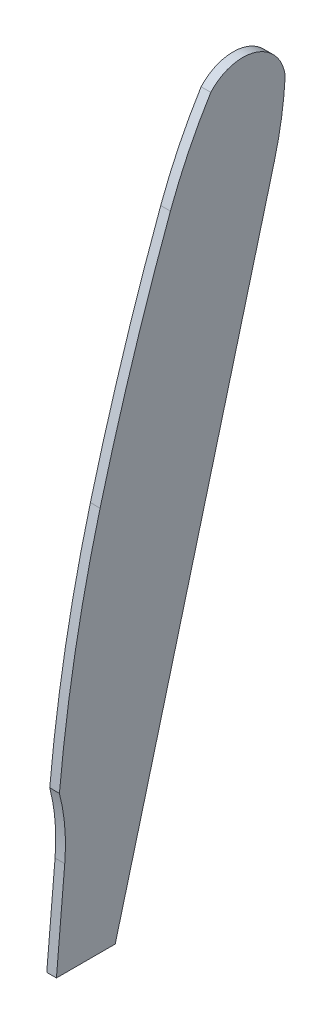
ISO-10303-21;
HEADER;
FILE_DESCRIPTION(('STEP AP214'),'2;1');
FILE_NAME('part.step','',(''),(''),'','','');
FILE_SCHEMA(('AUTOMOTIVE_DESIGN { 1 0 10303 214 1 1 1 1 }'));
ENDSEC;
DATA;
#1=APPLICATION_CONTEXT('core data for automotive mechanical design processes');
#2=APPLICATION_PROTOCOL_DEFINITION('international standard','automotive_design',2000,#1);
#3=PRODUCT_CONTEXT('',#1,'mechanical');
#4=PRODUCT('Part','Part','',(#3));
#5=PRODUCT_RELATED_PRODUCT_CATEGORY('part','',(#4));
#6=PRODUCT_DEFINITION_FORMATION('','',#4);
#7=PRODUCT_DEFINITION_CONTEXT('part definition',#1,'design');
#8=PRODUCT_DEFINITION('design','',#6,#7);
#9=PRODUCT_DEFINITION_SHAPE('','',#8);
#10=(LENGTH_UNIT() NAMED_UNIT(*) SI_UNIT(.MILLI.,.METRE.));
#11=(NAMED_UNIT(*) PLANE_ANGLE_UNIT() SI_UNIT($,.RADIAN.));
#12=(NAMED_UNIT(*) SI_UNIT($,.STERADIAN.) SOLID_ANGLE_UNIT());
#13=UNCERTAINTY_MEASURE_WITH_UNIT(LENGTH_MEASURE(1.E-05),#10,'distance_accuracy_value','');
#14=(GEOMETRIC_REPRESENTATION_CONTEXT(3) GLOBAL_UNCERTAINTY_ASSIGNED_CONTEXT((#13)) GLOBAL_UNIT_ASSIGNED_CONTEXT((#10,
#11,#12)) REPRESENTATION_CONTEXT('',''));
#15=CARTESIAN_POINT('',(0.,0.,0.));
#16=DIRECTION('',(0.,0.,1.));
#17=DIRECTION('',(1.,0.,0.));
#18=AXIS2_PLACEMENT_3D('',#15,#16,#17);
#19=CARTESIAN_POINT('',(1.4,0.,-8.5));
#20=DIRECTION('',(0.,1.,0.));
#21=DIRECTION('',(0.,0.,1.));
#22=AXIS2_PLACEMENT_3D('',#19,#20,#21);
#23=PLANE('',#22);
#24=DIRECTION('',(0.,0.,-1.));
#25=VECTOR('',#24,1.);
#26=CARTESIAN_POINT('',(0.,0.,-8.5));
#27=LINE('',#26,#25);
#28=CARTESIAN_POINT('',(0.,0.,0.));
#29=VERTEX_POINT('',#28);
#30=CARTESIAN_POINT('',(0.,0.,-8.5));
#31=VERTEX_POINT('',#30);
#32=EDGE_CURVE('E137',#29,#31,#27,.T.);
#33=ORIENTED_EDGE('',*,*,#32,.T.);
#34=DIRECTION('',(-1.,0.,0.));
#35=VECTOR('',#34,1.);
#36=CARTESIAN_POINT('',(1.4,0.,-8.5));
#37=LINE('',#36,#35);
#38=CARTESIAN_POINT('',(1.4,0.,-8.5));
#39=VERTEX_POINT('',#38);
#40=EDGE_CURVE('E11',#39,#31,#37,.T.);
#41=ORIENTED_EDGE('',*,*,#40,.F.);
#42=DIRECTION('',(0.,0.,-1.));
#43=VECTOR('',#42,1.);
#44=CARTESIAN_POINT('',(1.4,0.,-8.5));
#45=LINE('',#44,#43);
#46=CARTESIAN_POINT('',(1.4,0.,0.));
#47=VERTEX_POINT('',#46);
#48=EDGE_CURVE('E153',#47,#39,#45,.T.);
#49=ORIENTED_EDGE('',*,*,#48,.F.);
#50=DIRECTION('',(-1.,0.,0.));
#51=VECTOR('',#50,1.);
#52=CARTESIAN_POINT('',(1.4,0.,0.));
#53=LINE('',#52,#51);
#54=EDGE_CURVE('E133',#47,#29,#53,.T.);
#55=ORIENTED_EDGE('',*,*,#54,.T.);
#56=EDGE_LOOP('',(#33,#41,#49,#55));
#57=FACE_BOUND('',#56,.T.);
#58=ADVANCED_FACE('F35',(#57),#23,.F.);
#59=CARTESIAN_POINT('',(1.4,0.,-8.5));
#60=DIRECTION('',(0.,0.257025772581627,0.96640454894874));
#61=DIRECTION('',(0.,-0.96640454894874,0.257025772581627));
#62=AXIS2_PLACEMENT_3D('',#59,#60,#61);
#63=PLANE('',#62);
#64=DIRECTION('',(0.,0.96640454894874,-0.257025772581627));
#65=VECTOR('',#64,1.);
#66=CARTESIAN_POINT('',(0.,0.,-8.5));
#67=LINE('',#66,#65);
#68=CARTESIAN_POINT('',(0.,86.464518252935,-31.4961765277634));
#69=VERTEX_POINT('',#68);
#70=EDGE_CURVE('E140',#31,#69,#67,.T.);
#71=ORIENTED_EDGE('',*,*,#70,.T.);
#72=DIRECTION('',(-1.,0.,0.));
#73=VECTOR('',#72,1.);
#74=CARTESIAN_POINT('',(1.4,86.464518252935,-31.4961765277634));
#75=LINE('',#74,#73);
#76=CARTESIAN_POINT('',(1.4,86.464518252935,-31.4961765277634));
#77=VERTEX_POINT('',#76);
#78=EDGE_CURVE('E43',#77,#69,#75,.T.);
#79=ORIENTED_EDGE('',*,*,#78,.F.);
#80=DIRECTION('',(0.,0.96640454894874,-0.257025772581627));
#81=VECTOR('',#80,1.);
#82=CARTESIAN_POINT('',(1.4,0.,-8.5));
#83=LINE('',#82,#81);
#84=EDGE_CURVE('E97',#39,#77,#83,.T.);
#85=ORIENTED_EDGE('',*,*,#84,.F.);
#86=ORIENTED_EDGE('',*,*,#40,.T.);
#87=EDGE_LOOP('',(#71,#79,#85,#86));
#88=FACE_BOUND('',#87,.T.);
#89=ADVANCED_FACE('F196',(#88),#63,.F.);
#90=CARTESIAN_POINT('',(1.4,99.2010653887143,16.3926284208069));
#91=DIRECTION('',(-1.,0.,0.));
#92=DIRECTION('',(0.,0.,1.));
#93=AXIS2_PLACEMENT_3D('',#90,#91,#92);
#94=CYLINDRICAL_SURFACE('',#93,49.5535798136133);
#95=CARTESIAN_POINT('',(0.,99.2010653887143,16.3926284208069));
#96=DIRECTION('',(1.,0.,0.));
#97=DIRECTION('',(0.,0.,-1.));
#98=AXIS2_PLACEMENT_3D('',#95,#96,#97);
#99=CIRCLE('',#98,49.5535798136133);
#100=CARTESIAN_POINT('',(0.,96.5026239787442,-33.0874249977283));
#101=VERTEX_POINT('',#100);
#102=EDGE_CURVE('E142',#69,#101,#99,.T.);
#103=ORIENTED_EDGE('',*,*,#102,.T.);
#104=DIRECTION('',(-1.,0.,0.));
#105=VECTOR('',#104,1.);
#106=CARTESIAN_POINT('',(1.4,96.5026239787442,-33.0874249977283));
#107=LINE('',#106,#105);
#108=CARTESIAN_POINT('',(1.4,96.5026239787442,-33.0874249977283));
#109=VERTEX_POINT('',#108);
#110=EDGE_CURVE('E163',#109,#101,#107,.T.);
#111=ORIENTED_EDGE('',*,*,#110,.F.);
#112=CARTESIAN_POINT('',(1.4,99.2010653887143,16.3926284208069));
#113=DIRECTION('',(1.,0.,0.));
#114=DIRECTION('',(0.,0.,-1.));
#115=AXIS2_PLACEMENT_3D('',#112,#113,#114);
#116=CIRCLE('',#115,49.5535798136133);
#117=EDGE_CURVE('E171',#77,#109,#116,.T.);
#118=ORIENTED_EDGE('',*,*,#117,.F.);
#119=ORIENTED_EDGE('',*,*,#78,.T.);
#120=EDGE_LOOP('',(#103,#111,#118,#119));
#121=FACE_BOUND('',#120,.T.);
#122=ADVANCED_FACE('F169',(#121),#94,.T.);
#123=CARTESIAN_POINT('',(1.4,95.6035626525631,-26.940646976806));
#124=DIRECTION('',(-1.,0.,0.));
#125=DIRECTION('',(0.,0.,1.));
#126=AXIS2_PLACEMENT_3D('',#123,#124,#125);
#127=CYLINDRICAL_SURFACE('',#126,6.21218088168139);
#128=CARTESIAN_POINT('',(0.,95.6035626525631,-26.940646976806));
#129=DIRECTION('',(1.,0.,0.));
#130=DIRECTION('',(0.,0.,-1.));
#131=AXIS2_PLACEMENT_3D('',#128,#129,#130);
#132=CIRCLE('',#131,6.21218088168139);
#133=CARTESIAN_POINT('',(0.,99.7570947955704,-22.3211922423451));
#134=VERTEX_POINT('',#133);
#135=EDGE_CURVE('E144',#101,#134,#132,.T.);
#136=ORIENTED_EDGE('',*,*,#135,.T.);
#137=DIRECTION('',(-1.,0.,0.));
#138=VECTOR('',#137,1.);
#139=CARTESIAN_POINT('',(1.4,99.7570947955704,-22.3211922423451));
#140=LINE('',#139,#138);
#141=CARTESIAN_POINT('',(1.4,99.7570947955704,-22.3211922423451));
#142=VERTEX_POINT('',#141);
#143=EDGE_CURVE('E160',#142,#134,#140,.T.);
#144=ORIENTED_EDGE('',*,*,#143,.F.);
#145=CARTESIAN_POINT('',(1.4,95.6035626525631,-26.940646976806));
#146=DIRECTION('',(1.,0.,0.));
#147=DIRECTION('',(0.,0.,-1.));
#148=AXIS2_PLACEMENT_3D('',#145,#146,#147);
#149=CIRCLE('',#148,6.21218088168139);
#150=EDGE_CURVE('E187',#109,#142,#149,.T.);
#151=ORIENTED_EDGE('',*,*,#150,.F.);
#152=ORIENTED_EDGE('',*,*,#110,.T.);
#153=EDGE_LOOP('',(#136,#144,#151,#152));
#154=FACE_BOUND('',#153,.T.);
#155=ADVANCED_FACE('F180',(#154),#127,.T.);
#156=CARTESIAN_POINT('',(1.4,64.8381695956375,-78.6382028272435));
#157=DIRECTION('',(-1.,0.,0.));
#158=DIRECTION('',(0.,0.,1.));
#159=AXIS2_PLACEMENT_3D('',#156,#157,#158);
#160=CYLINDRICAL_SURFACE('',#159,66.264145797996);
#161=CARTESIAN_POINT('',(0.,64.8381695956375,-78.6382028272435));
#162=DIRECTION('',(1.,0.,0.));
#163=DIRECTION('',(0.,0.,1.));
#164=AXIS2_PLACEMENT_3D('',#161,#162,#163);
#165=CIRCLE('',#164,66.264145797996);
#166=CARTESIAN_POINT('',(0.,87.7991910712251,-16.4793055466798));
#167=VERTEX_POINT('',#166);
#168=EDGE_CURVE('E146',#134,#167,#165,.T.);
#169=ORIENTED_EDGE('',*,*,#168,.T.);
#170=DIRECTION('',(-1.,0.,0.));
#171=VECTOR('',#170,1.);
#172=CARTESIAN_POINT('',(1.4,87.7991910712251,-16.4793055466798));
#173=LINE('',#172,#171);
#174=CARTESIAN_POINT('',(1.4,87.7991910712251,-16.4793055466798));
#175=VERTEX_POINT('',#174);
#176=EDGE_CURVE('E157',#175,#167,#173,.T.);
#177=ORIENTED_EDGE('',*,*,#176,.F.);
#178=CARTESIAN_POINT('',(1.4,64.8381695956375,-78.6382028272435));
#179=DIRECTION('',(1.,0.,0.));
#180=DIRECTION('',(0.,0.,1.));
#181=AXIS2_PLACEMENT_3D('',#178,#179,#180);
#182=CIRCLE('',#181,66.264145797996);
#183=EDGE_CURVE('E186',#142,#175,#182,.T.);
#184=ORIENTED_EDGE('',*,*,#183,.F.);
#185=ORIENTED_EDGE('',*,*,#143,.T.);
#186=EDGE_LOOP('',(#169,#177,#184,#185));
#187=FACE_BOUND('',#186,.T.);
#188=ADVANCED_FACE('F184',(#187),#160,.T.);
#189=CARTESIAN_POINT('',(1.4,-35.9600301965743,-351.513908884616));
#190=DIRECTION('',(-1.,0.,0.));
#191=DIRECTION('',(0.,0.,1.));
#192=AXIS2_PLACEMENT_3D('',#189,#190,#191);
#193=CYLINDRICAL_SURFACE('',#192,357.161770466298);
#194=CARTESIAN_POINT('',(0.,-35.9600301965743,-351.513908884616));
#195=DIRECTION('',(1.,0.,0.));
#196=DIRECTION('',(0.,0.,1.));
#197=AXIS2_PLACEMENT_3D('',#194,#195,#196);
#198=CIRCLE('',#197,357.161770466298);
#199=CARTESIAN_POINT('',(0.,55.6832842812047,-6.30957346261224));
#200=VERTEX_POINT('',#199);
#201=EDGE_CURVE('E148',#167,#200,#198,.T.);
#202=ORIENTED_EDGE('',*,*,#201,.T.);
#203=DIRECTION('',(-1.,0.,0.));
#204=VECTOR('',#203,1.);
#205=CARTESIAN_POINT('',(1.4,55.6832842812047,-6.30957346261224));
#206=LINE('',#205,#204);
#207=CARTESIAN_POINT('',(1.4,55.6832842812047,-6.30957346261224));
#208=VERTEX_POINT('',#207);
#209=EDGE_CURVE('E128',#208,#200,#206,.T.);
#210=ORIENTED_EDGE('',*,*,#209,.F.);
#211=CARTESIAN_POINT('',(1.4,-35.9600301965743,-351.513908884616));
#212=DIRECTION('',(1.,0.,0.));
#213=DIRECTION('',(0.,0.,1.));
#214=AXIS2_PLACEMENT_3D('',#211,#212,#213);
#215=CIRCLE('',#214,357.161770466298);
#216=EDGE_CURVE('E119',#175,#208,#215,.T.);
#217=ORIENTED_EDGE('',*,*,#216,.F.);
#218=ORIENTED_EDGE('',*,*,#176,.T.);
#219=EDGE_LOOP('',(#202,#210,#217,#218));
#220=FACE_BOUND('',#219,.T.);
#221=ADVANCED_FACE('F208',(#220),#193,.T.);
#222=CARTESIAN_POINT('',(1.4,3.48156872186903,-202.944304869215));
#223=DIRECTION('',(-1.,0.,0.));
#224=DIRECTION('',(0.,0.,1.));
#225=AXIS2_PLACEMENT_3D('',#222,#223,#224);
#226=CYLINDRICAL_SURFACE('',#225,203.445906084848);
#227=CARTESIAN_POINT('',(0.,3.48156872186903,-202.944304869215));
#228=DIRECTION('',(1.,0.,0.));
#229=DIRECTION('',(0.,0.,-1.));
#230=AXIS2_PLACEMENT_3D('',#227,#228,#229);
#231=CIRCLE('',#230,203.445906084848);
#232=CARTESIAN_POINT('',(0.,22.9077607824969,-0.42798512014347));
#233=VERTEX_POINT('',#232);
#234=EDGE_CURVE('E127',#200,#233,#231,.T.);
#235=ORIENTED_EDGE('',*,*,#234,.T.);
#236=DIRECTION('',(-1.,0.,0.));
#237=VECTOR('',#236,1.);
#238=CARTESIAN_POINT('',(1.4,22.9077607824969,-0.42798512014347));
#239=LINE('',#238,#237);
#240=CARTESIAN_POINT('',(1.4,22.9077607824969,-0.42798512014347));
#241=VERTEX_POINT('',#240);
#242=EDGE_CURVE('E124',#241,#233,#239,.T.);
#243=ORIENTED_EDGE('',*,*,#242,.F.);
#244=CARTESIAN_POINT('',(1.4,3.48156872186903,-202.944304869215));
#245=DIRECTION('',(1.,0.,0.));
#246=DIRECTION('',(0.,0.,-1.));
#247=AXIS2_PLACEMENT_3D('',#244,#245,#246);
#248=CIRCLE('',#247,203.445906084848);
#249=EDGE_CURVE('E113',#208,#241,#248,.T.);
#250=ORIENTED_EDGE('',*,*,#249,.F.);
#251=ORIENTED_EDGE('',*,*,#209,.T.);
#252=EDGE_LOOP('',(#235,#243,#250,#251));
#253=FACE_BOUND('',#252,.T.);
#254=ADVANCED_FACE('F125',(#253),#226,.T.);
#255=CARTESIAN_POINT('',(1.4,16.0787244802433,25.7745970400898));
#256=DIRECTION('',(-1.,0.,0.));
#257=DIRECTION('',(0.,0.,1.));
#258=AXIS2_PLACEMENT_3D('',#255,#256,#257);
#259=CYLINDRICAL_SURFACE('',#258,27.0778700912992);
#260=CARTESIAN_POINT('',(0.,16.0787244802433,25.7745970400898));
#261=DIRECTION('',(-1.,0.,0.));
#262=DIRECTION('',(0.,0.,-1.));
#263=AXIS2_PLACEMENT_3D('',#260,#261,#262);
#264=CIRCLE('',#263,27.0778700912992);
#265=CARTESIAN_POINT('',(0.,13.7187326004116,-1.20023358047949));
#266=VERTEX_POINT('',#265);
#267=EDGE_CURVE('E83',#233,#266,#264,.T.);
#268=ORIENTED_EDGE('',*,*,#267,.T.);
#269=DIRECTION('',(-1.,0.,0.));
#270=VECTOR('',#269,1.);
#271=CARTESIAN_POINT('',(1.4,13.7187326004116,-1.20023358047949));
#272=LINE('',#271,#270);
#273=CARTESIAN_POINT('',(1.4,13.7187326004116,-1.20023358047949));
#274=VERTEX_POINT('',#273);
#275=EDGE_CURVE('E129',#274,#266,#272,.T.);
#276=ORIENTED_EDGE('',*,*,#275,.F.);
#277=CARTESIAN_POINT('',(1.4,16.0787244802433,25.7745970400898));
#278=DIRECTION('',(-1.,0.,0.));
#279=DIRECTION('',(0.,0.,-1.));
#280=AXIS2_PLACEMENT_3D('',#277,#278,#279);
#281=CIRCLE('',#280,27.0778700912992);
#282=EDGE_CURVE('E117',#241,#274,#281,.T.);
#283=ORIENTED_EDGE('',*,*,#282,.F.);
#284=ORIENTED_EDGE('',*,*,#242,.T.);
#285=EDGE_LOOP('',(#268,#276,#283,#284));
#286=FACE_BOUND('',#285,.T.);
#287=ADVANCED_FACE('F131',(#286),#259,.F.);
#288=CARTESIAN_POINT('',(1.4,0.,0.));
#289=DIRECTION('',(0.,-0.0871557427476544,-0.996194698091746));
#290=DIRECTION('',(0.,0.996194698091746,-0.0871557427476544));
#291=AXIS2_PLACEMENT_3D('',#288,#289,#290);
#292=PLANE('',#291);
#293=DIRECTION('',(0.,-0.996194698091746,0.0871557427476544));
#294=VECTOR('',#293,1.);
#295=CARTESIAN_POINT('',(0.,0.,0.));
#296=LINE('',#295,#294);
#297=EDGE_CURVE('E89',#266,#29,#296,.T.);
#298=ORIENTED_EDGE('',*,*,#297,.T.);
#299=ORIENTED_EDGE('',*,*,#54,.F.);
#300=DIRECTION('',(0.,-0.996194698091746,0.0871557427476544));
#301=VECTOR('',#300,1.);
#302=CARTESIAN_POINT('',(1.4,0.,0.));
#303=LINE('',#302,#301);
#304=EDGE_CURVE('E51',#274,#47,#303,.T.);
#305=ORIENTED_EDGE('',*,*,#304,.F.);
#306=ORIENTED_EDGE('',*,*,#275,.T.);
#307=EDGE_LOOP('',(#298,#299,#305,#306));
#308=FACE_BOUND('',#307,.T.);
#309=ADVANCED_FACE('F216',(#308),#292,.F.);
#310=CARTESIAN_POINT('',(1.4,16.0787244802433,25.7745970400898));
#311=DIRECTION('',(1.,0.,0.));
#312=DIRECTION('',(0.,0.,-1.));
#313=AXIS2_PLACEMENT_3D('',#310,#311,#312);
#314=PLANE('',#313);
#315=ORIENTED_EDGE('',*,*,#48,.T.);
#316=ORIENTED_EDGE('',*,*,#84,.T.);
#317=ORIENTED_EDGE('',*,*,#117,.T.);
#318=ORIENTED_EDGE('',*,*,#150,.T.);
#319=ORIENTED_EDGE('',*,*,#183,.T.);
#320=ORIENTED_EDGE('',*,*,#216,.T.);
#321=ORIENTED_EDGE('',*,*,#249,.T.);
#322=ORIENTED_EDGE('',*,*,#282,.T.);
#323=ORIENTED_EDGE('',*,*,#304,.T.);
#324=EDGE_LOOP('',(#315,#316,#317,#318,#319,#320,#321,#322,#323));
#325=FACE_BOUND('',#324,.T.);
#326=ADVANCED_FACE('F115',(#325),#314,.T.);
#327=CARTESIAN_POINT('',(0.,16.0787244802433,25.7745970400898));
#328=DIRECTION('',(1.,0.,0.));
#329=DIRECTION('',(0.,0.,-1.));
#330=AXIS2_PLACEMENT_3D('',#327,#328,#329);
#331=PLANE('',#330);
#332=ORIENTED_EDGE('',*,*,#32,.F.);
#333=ORIENTED_EDGE('',*,*,#297,.F.);
#334=ORIENTED_EDGE('',*,*,#267,.F.);
#335=ORIENTED_EDGE('',*,*,#234,.F.);
#336=ORIENTED_EDGE('',*,*,#201,.F.);
#337=ORIENTED_EDGE('',*,*,#168,.F.);
#338=ORIENTED_EDGE('',*,*,#135,.F.);
#339=ORIENTED_EDGE('',*,*,#102,.F.);
#340=ORIENTED_EDGE('',*,*,#70,.F.);
#341=EDGE_LOOP('',(#332,#333,#334,#335,#336,#337,#338,#339,#340));
#342=FACE_BOUND('',#341,.T.);
#343=ADVANCED_FACE('F175',(#342),#331,.F.);
#344=CLOSED_SHELL('',(#58,#89,#122,#155,#188,#221,#254,#287,#309,#326,#343));
#345=MANIFOLD_SOLID_BREP('B2',#344);
#346=ADVANCED_BREP_SHAPE_REPRESENTATION('',(#18,#345),#14);
#347=SHAPE_DEFINITION_REPRESENTATION(#9,#346);
ENDSEC;
END-ISO-10303-21;
